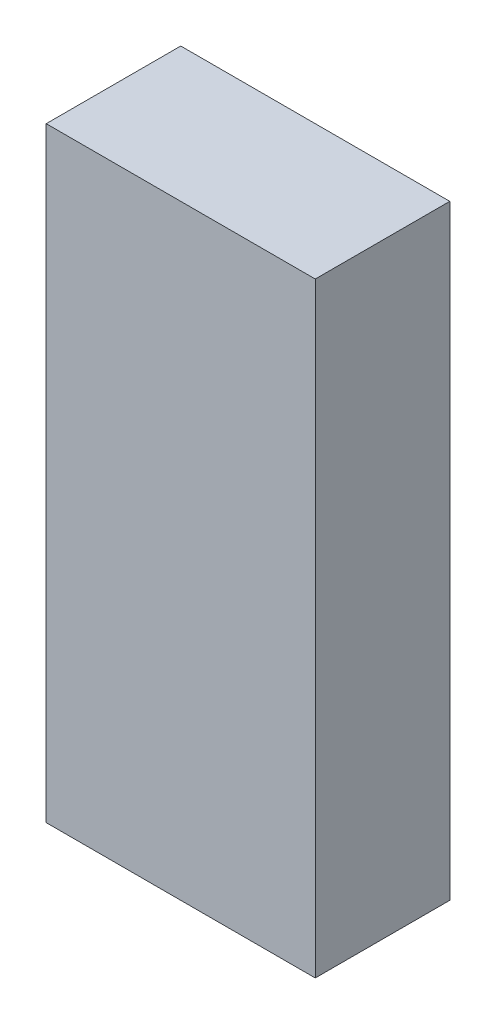
ISO-10303-21;
HEADER;
FILE_DESCRIPTION(('STEP AP214'),'2;1');
FILE_NAME('part.step','',(''),(''),'','','');
FILE_SCHEMA(('AUTOMOTIVE_DESIGN { 1 0 10303 214 1 1 1 1 }'));
ENDSEC;
DATA;
#1=APPLICATION_CONTEXT('core data for automotive mechanical design processes');
#2=APPLICATION_PROTOCOL_DEFINITION('international standard','automotive_design',2000,#1);
#3=PRODUCT_CONTEXT('',#1,'mechanical');
#4=PRODUCT('Part','Part','',(#3));
#5=PRODUCT_RELATED_PRODUCT_CATEGORY('part','',(#4));
#6=PRODUCT_DEFINITION_FORMATION('','',#4);
#7=PRODUCT_DEFINITION_CONTEXT('part definition',#1,'design');
#8=PRODUCT_DEFINITION('design','',#6,#7);
#9=PRODUCT_DEFINITION_SHAPE('','',#8);
#10=(LENGTH_UNIT() NAMED_UNIT(*) SI_UNIT(.MILLI.,.METRE.));
#11=(NAMED_UNIT(*) PLANE_ANGLE_UNIT() SI_UNIT($,.RADIAN.));
#12=(NAMED_UNIT(*) SI_UNIT($,.STERADIAN.) SOLID_ANGLE_UNIT());
#13=UNCERTAINTY_MEASURE_WITH_UNIT(LENGTH_MEASURE(1.E-05),#10,'distance_accuracy_value','');
#14=(GEOMETRIC_REPRESENTATION_CONTEXT(3) GLOBAL_UNCERTAINTY_ASSIGNED_CONTEXT((#13)) GLOBAL_UNIT_ASSIGNED_CONTEXT((#10,
#11,#12)) REPRESENTATION_CONTEXT('',''));
#15=CARTESIAN_POINT('',(0.,0.,0.));
#16=DIRECTION('',(0.,0.,1.));
#17=DIRECTION('',(1.,0.,0.));
#18=AXIS2_PLACEMENT_3D('',#15,#16,#17);
#19=CARTESIAN_POINT('',(-0.1,2.525,0.));
#20=DIRECTION('',(1.,0.,0.));
#21=DIRECTION('',(0.,0.,1.));
#22=AXIS2_PLACEMENT_3D('',#19,#20,#21);
#23=PLANE('',#22);
#24=DIRECTION('',(0.,1.,0.));
#25=VECTOR('',#24,1.);
#26=CARTESIAN_POINT('',(-0.1,2.525,0.1));
#27=LINE('',#26,#25);
#28=CARTESIAN_POINT('',(-0.1,2.525,0.1));
#29=VERTEX_POINT('',#28);
#30=CARTESIAN_POINT('',(-0.1,2.975,0.1));
#31=VERTEX_POINT('',#30);
#32=EDGE_CURVE('E11',#29,#31,#27,.T.);
#33=ORIENTED_EDGE('',*,*,#32,.T.);
#34=DIRECTION('',(0.,0.,1.));
#35=VECTOR('',#34,1.);
#36=CARTESIAN_POINT('',(-0.1,2.975,0.));
#37=LINE('',#36,#35);
#38=CARTESIAN_POINT('',(-0.1,2.975,0.));
#39=VERTEX_POINT('',#38);
#40=EDGE_CURVE('E24',#39,#31,#37,.T.);
#41=ORIENTED_EDGE('',*,*,#40,.F.);
#42=DIRECTION('',(0.,1.,0.));
#43=VECTOR('',#42,1.);
#44=CARTESIAN_POINT('',(-0.1,2.525,0.));
#45=LINE('',#44,#43);
#46=CARTESIAN_POINT('',(-0.1,2.525,0.));
#47=VERTEX_POINT('',#46);
#48=EDGE_CURVE('E86',#47,#39,#45,.T.);
#49=ORIENTED_EDGE('',*,*,#48,.F.);
#50=DIRECTION('',(0.,0.,1.));
#51=VECTOR('',#50,1.);
#52=CARTESIAN_POINT('',(-0.1,2.525,0.));
#53=LINE('',#52,#51);
#54=EDGE_CURVE('E36',#47,#29,#53,.T.);
#55=ORIENTED_EDGE('',*,*,#54,.T.);
#56=EDGE_LOOP('',(#33,#41,#49,#55));
#57=FACE_BOUND('',#56,.T.);
#58=ADVANCED_FACE('F17',(#57),#23,.F.);
#59=CARTESIAN_POINT('',(0.1,2.525,0.));
#60=DIRECTION('',(1.,0.,0.));
#61=DIRECTION('',(0.,0.,1.));
#62=AXIS2_PLACEMENT_3D('',#59,#60,#61);
#63=PLANE('',#62);
#64=DIRECTION('',(0.,0.,1.));
#65=VECTOR('',#64,1.);
#66=CARTESIAN_POINT('',(0.1,2.525,0.));
#67=LINE('',#66,#65);
#68=CARTESIAN_POINT('',(0.1,2.525,0.));
#69=VERTEX_POINT('',#68);
#70=CARTESIAN_POINT('',(0.1,2.525,0.1));
#71=VERTEX_POINT('',#70);
#72=EDGE_CURVE('E83',#69,#71,#67,.T.);
#73=ORIENTED_EDGE('',*,*,#72,.F.);
#74=DIRECTION('',(0.,1.,0.));
#75=VECTOR('',#74,1.);
#76=CARTESIAN_POINT('',(0.1,2.525,0.));
#77=LINE('',#76,#75);
#78=CARTESIAN_POINT('',(0.1,2.975,0.));
#79=VERTEX_POINT('',#78);
#80=EDGE_CURVE('E63',#69,#79,#77,.T.);
#81=ORIENTED_EDGE('',*,*,#80,.T.);
#82=DIRECTION('',(0.,0.,1.));
#83=VECTOR('',#82,1.);
#84=CARTESIAN_POINT('',(0.1,2.975,0.));
#85=LINE('',#84,#83);
#86=CARTESIAN_POINT('',(0.1,2.975,0.1));
#87=VERTEX_POINT('',#86);
#88=EDGE_CURVE('E57',#79,#87,#85,.T.);
#89=ORIENTED_EDGE('',*,*,#88,.T.);
#90=DIRECTION('',(0.,1.,0.));
#91=VECTOR('',#90,1.);
#92=CARTESIAN_POINT('',(0.1,2.525,0.1));
#93=LINE('',#92,#91);
#94=EDGE_CURVE('E60',#71,#87,#93,.T.);
#95=ORIENTED_EDGE('',*,*,#94,.F.);
#96=EDGE_LOOP('',(#73,#81,#89,#95));
#97=FACE_BOUND('',#96,.T.);
#98=ADVANCED_FACE('F59',(#97),#63,.T.);
#99=CARTESIAN_POINT('',(-0.1,2.525,0.));
#100=DIRECTION('',(0.,1.,0.));
#101=DIRECTION('',(0.,0.,1.));
#102=AXIS2_PLACEMENT_3D('',#99,#100,#101);
#103=PLANE('',#102);
#104=ORIENTED_EDGE('',*,*,#72,.T.);
#105=DIRECTION('',(1.,0.,0.));
#106=VECTOR('',#105,1.);
#107=CARTESIAN_POINT('',(-0.1,2.525,0.1));
#108=LINE('',#107,#106);
#109=EDGE_CURVE('E71',#29,#71,#108,.T.);
#110=ORIENTED_EDGE('',*,*,#109,.F.);
#111=ORIENTED_EDGE('',*,*,#54,.F.);
#112=DIRECTION('',(1.,0.,0.));
#113=VECTOR('',#112,1.);
#114=CARTESIAN_POINT('',(-0.1,2.525,0.));
#115=LINE('',#114,#113);
#116=EDGE_CURVE('E76',#47,#69,#115,.T.);
#117=ORIENTED_EDGE('',*,*,#116,.T.);
#118=EDGE_LOOP('',(#104,#110,#111,#117));
#119=FACE_BOUND('',#118,.T.);
#120=ADVANCED_FACE('F91',(#119),#103,.F.);
#121=CARTESIAN_POINT('',(-0.1,2.975,0.));
#122=DIRECTION('',(0.,1.,0.));
#123=DIRECTION('',(0.,0.,1.));
#124=AXIS2_PLACEMENT_3D('',#121,#122,#123);
#125=PLANE('',#124);
#126=DIRECTION('',(1.,0.,0.));
#127=VECTOR('',#126,1.);
#128=CARTESIAN_POINT('',(-0.1,2.975,0.));
#129=LINE('',#128,#127);
#130=EDGE_CURVE('E74',#39,#79,#129,.T.);
#131=ORIENTED_EDGE('',*,*,#130,.F.);
#132=ORIENTED_EDGE('',*,*,#40,.T.);
#133=DIRECTION('',(1.,0.,0.));
#134=VECTOR('',#133,1.);
#135=CARTESIAN_POINT('',(-0.1,2.975,0.1));
#136=LINE('',#135,#134);
#137=EDGE_CURVE('E69',#31,#87,#136,.T.);
#138=ORIENTED_EDGE('',*,*,#137,.T.);
#139=ORIENTED_EDGE('',*,*,#88,.F.);
#140=EDGE_LOOP('',(#131,#132,#138,#139));
#141=FACE_BOUND('',#140,.T.);
#142=ADVANCED_FACE('F73',(#141),#125,.T.);
#143=CARTESIAN_POINT('',(-0.1,2.525,0.));
#144=DIRECTION('',(0.,0.,1.));
#145=DIRECTION('',(1.,0.,0.));
#146=AXIS2_PLACEMENT_3D('',#143,#144,#145);
#147=PLANE('',#146);
#148=ORIENTED_EDGE('',*,*,#130,.T.);
#149=ORIENTED_EDGE('',*,*,#80,.F.);
#150=ORIENTED_EDGE('',*,*,#116,.F.);
#151=ORIENTED_EDGE('',*,*,#48,.T.);
#152=EDGE_LOOP('',(#148,#149,#150,#151));
#153=FACE_BOUND('',#152,.T.);
#154=ADVANCED_FACE('F89',(#153),#147,.F.);
#155=CARTESIAN_POINT('',(-0.1,2.525,0.1));
#156=DIRECTION('',(0.,0.,1.));
#157=DIRECTION('',(1.,0.,0.));
#158=AXIS2_PLACEMENT_3D('',#155,#156,#157);
#159=PLANE('',#158);
#160=ORIENTED_EDGE('',*,*,#32,.F.);
#161=ORIENTED_EDGE('',*,*,#109,.T.);
#162=ORIENTED_EDGE('',*,*,#94,.T.);
#163=ORIENTED_EDGE('',*,*,#137,.F.);
#164=EDGE_LOOP('',(#160,#161,#162,#163));
#165=FACE_BOUND('',#164,.T.);
#166=ADVANCED_FACE('F68',(#165),#159,.T.);
#167=CLOSED_SHELL('',(#58,#98,#120,#142,#154,#166));
#168=MANIFOLD_SOLID_BREP('B1',#167);
#169=ADVANCED_BREP_SHAPE_REPRESENTATION('',(#18,#168),#14);
#170=SHAPE_DEFINITION_REPRESENTATION(#9,#169);
ENDSEC;
END-ISO-10303-21;
